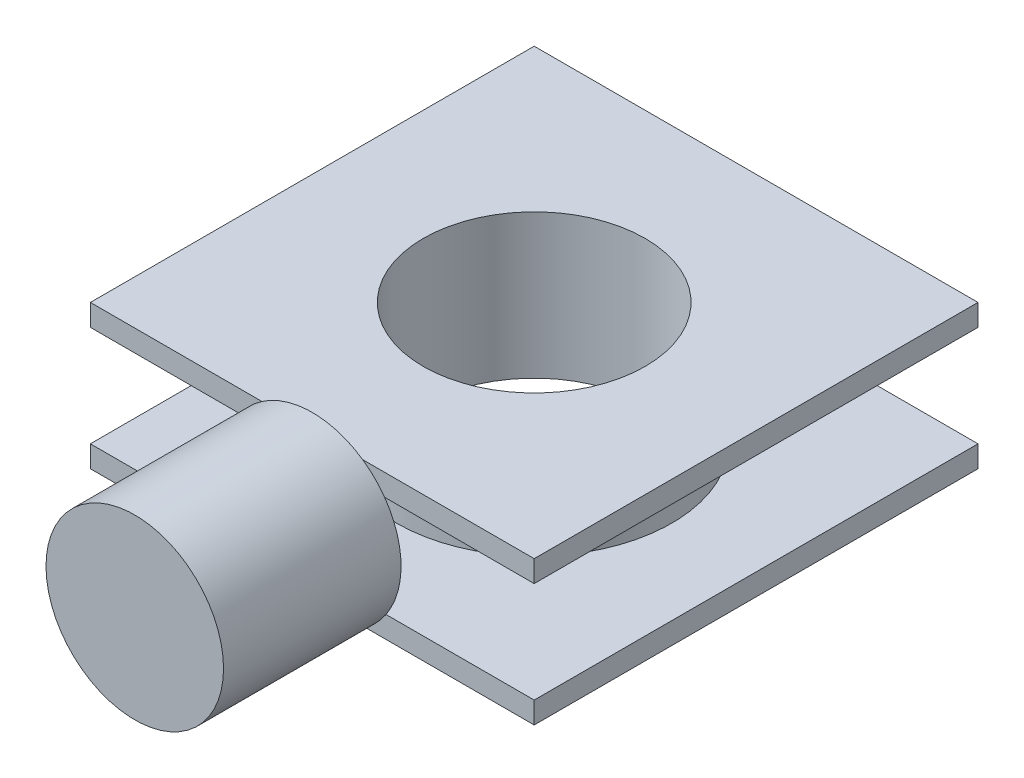
ISO-10303-21;
HEADER;
FILE_DESCRIPTION(('STEP AP214'),'2;1');
FILE_NAME('part.step','',(''),(''),'','','');
FILE_SCHEMA(('AUTOMOTIVE_DESIGN { 1 0 10303 214 1 1 1 1 }'));
ENDSEC;
DATA;
#1=APPLICATION_CONTEXT('core data for automotive mechanical design processes');
#2=APPLICATION_PROTOCOL_DEFINITION('international standard','automotive_design',2000,#1);
#3=PRODUCT_CONTEXT('',#1,'mechanical');
#4=PRODUCT('Part','Part','',(#3));
#5=PRODUCT_RELATED_PRODUCT_CATEGORY('part','',(#4));
#6=PRODUCT_DEFINITION_FORMATION('','',#4);
#7=PRODUCT_DEFINITION_CONTEXT('part definition',#1,'design');
#8=PRODUCT_DEFINITION('design','',#6,#7);
#9=PRODUCT_DEFINITION_SHAPE('','',#8);
#10=(LENGTH_UNIT() NAMED_UNIT(*) SI_UNIT(.MILLI.,.METRE.));
#11=(NAMED_UNIT(*) PLANE_ANGLE_UNIT() SI_UNIT($,.RADIAN.));
#12=(NAMED_UNIT(*) SI_UNIT($,.STERADIAN.) SOLID_ANGLE_UNIT());
#13=UNCERTAINTY_MEASURE_WITH_UNIT(LENGTH_MEASURE(1.E-05),#10,'distance_accuracy_value','');
#14=(GEOMETRIC_REPRESENTATION_CONTEXT(3) GLOBAL_UNCERTAINTY_ASSIGNED_CONTEXT((#13)) GLOBAL_UNIT_ASSIGNED_CONTEXT((#10,
#11,#12)) REPRESENTATION_CONTEXT('',''));
#15=CARTESIAN_POINT('',(0.,0.,0.));
#16=DIRECTION('',(0.,0.,1.));
#17=DIRECTION('',(1.,0.,0.));
#18=AXIS2_PLACEMENT_3D('',#15,#16,#17);
#19=CARTESIAN_POINT('',(0.,20.,25.));
#20=DIRECTION('',(0.,0.,1.));
#21=DIRECTION('',(1.,0.,0.));
#22=AXIS2_PLACEMENT_3D('',#19,#20,#21);
#23=PLANE('',#22);
#24=CARTESIAN_POINT('',(0.,8.,25.));
#25=DIRECTION('',(0.,0.,1.));
#26=DIRECTION('',(1.,0.,0.));
#27=AXIS2_PLACEMENT_3D('',#24,#25,#26);
#28=CIRCLE('',#27,10.);
#29=CARTESIAN_POINT('',(8.14972703725142,13.7949934614539,25.));
#30=VERTEX_POINT('',#29);
#31=CARTESIAN_POINT('',(5.67921824226726,16.2308249985466,25.));
#32=VERTEX_POINT('',#31);
#33=EDGE_CURVE('E53',#30,#32,#28,.T.);
#34=ORIENTED_EDGE('',*,*,#33,.F.);
#35=DIRECTION('',(-1.,0.,0.));
#36=VECTOR('',#35,1.);
#37=CARTESIAN_POINT('',(0.,13.7949934614539,25.));
#38=LINE('',#37,#36);
#39=CARTESIAN_POINT('',(25.,13.7949934614539,25.));
#40=VERTEX_POINT('',#39);
#41=EDGE_CURVE('E135',#40,#30,#38,.T.);
#42=ORIENTED_EDGE('',*,*,#41,.F.);
#43=DIRECTION('',(0.,-1.,0.));
#44=VECTOR('',#43,1.);
#45=CARTESIAN_POINT('',(25.,20.,25.));
#46=LINE('',#45,#44);
#47=CARTESIAN_POINT('',(25.,16.2308249985466,25.));
#48=VERTEX_POINT('',#47);
#49=EDGE_CURVE('E179',#48,#40,#46,.T.);
#50=ORIENTED_EDGE('',*,*,#49,.F.);
#51=DIRECTION('',(-1.,0.,0.));
#52=VECTOR('',#51,1.);
#53=CARTESIAN_POINT('',(0.,16.2308249985466,25.));
#54=LINE('',#53,#52);
#55=EDGE_CURVE('E39',#48,#32,#54,.T.);
#56=ORIENTED_EDGE('',*,*,#55,.T.);
#57=EDGE_LOOP('',(#34,#42,#50,#56));
#58=FACE_BOUND('',#57,.T.);
#59=ADVANCED_FACE('F35',(#58),#23,.T.);
#60=CARTESIAN_POINT('',(-8.30903299526411,2.43583153709268,25.));
#61=VERTEX_POINT('',#60);
#62=CARTESIAN_POINT('',(-6.00000000000001,0.,25.));
#63=VERTEX_POINT('',#62);
#64=EDGE_CURVE('E11',#61,#63,#28,.T.);
#65=ORIENTED_EDGE('',*,*,#64,.F.);
#66=DIRECTION('',(-1.,0.,0.));
#67=VECTOR('',#66,1.);
#68=CARTESIAN_POINT('',(0.,2.43583153709268,25.));
#69=LINE('',#68,#67);
#70=CARTESIAN_POINT('',(-25.,2.43583153709268,25.));
#71=VERTEX_POINT('',#70);
#72=EDGE_CURVE('E202',#61,#71,#69,.T.);
#73=ORIENTED_EDGE('',*,*,#72,.T.);
#74=DIRECTION('',(0.,-1.,0.));
#75=VECTOR('',#74,1.);
#76=CARTESIAN_POINT('',(-25.,20.,25.));
#77=LINE('',#76,#75);
#78=CARTESIAN_POINT('',(-25.,0.,25.));
#79=VERTEX_POINT('',#78);
#80=EDGE_CURVE('E186',#71,#79,#77,.T.);
#81=ORIENTED_EDGE('',*,*,#80,.T.);
#82=DIRECTION('',(-1.,0.,0.));
#83=VECTOR('',#82,1.);
#84=CARTESIAN_POINT('',(0.,0.,25.));
#85=LINE('',#84,#83);
#86=EDGE_CURVE('E167',#63,#79,#85,.T.);
#87=ORIENTED_EDGE('',*,*,#86,.F.);
#88=EDGE_LOOP('',(#65,#73,#81,#87));
#89=FACE_BOUND('',#88,.T.);
#90=ADVANCED_FACE('F242',(#89),#23,.T.);
#91=CARTESIAN_POINT('',(0.,0.,0.));
#92=DIRECTION('',(0.,1.,0.));
#93=DIRECTION('',(0.,0.,1.));
#94=AXIS2_PLACEMENT_3D('',#91,#92,#93);
#95=PLANE('',#94);
#96=CARTESIAN_POINT('',(0.,0.,0.));
#97=DIRECTION('',(0.,1.,0.));
#98=DIRECTION('',(0.,0.,1.));
#99=AXIS2_PLACEMENT_3D('',#96,#97,#98);
#100=CIRCLE('',#99,12.5);
#101=CARTESIAN_POINT('',(0.,0.,12.5));
#102=VERTEX_POINT('',#101);
#103=EDGE_CURVE('E205',#102,#102,#100,.T.);
#104=ORIENTED_EDGE('',*,*,#103,.T.);
#105=EDGE_LOOP('',(#104));
#106=FACE_BOUND('',#105,.T.);
#107=CARTESIAN_POINT('',(25.,0.,25.));
#108=VERTEX_POINT('',#107);
#109=CARTESIAN_POINT('',(6.00000000000002,0.,25.));
#110=VERTEX_POINT('',#109);
#111=EDGE_CURVE('E162',#108,#110,#85,.T.);
#112=ORIENTED_EDGE('',*,*,#111,.T.);
#113=EDGE_CURVE('E166',#110,#63,#85,.T.);
#114=ORIENTED_EDGE('',*,*,#113,.T.);
#115=ORIENTED_EDGE('',*,*,#86,.T.);
#116=DIRECTION('',(0.,0.,-1.));
#117=VECTOR('',#116,1.);
#118=CARTESIAN_POINT('',(-25.,0.,0.));
#119=LINE('',#118,#117);
#120=CARTESIAN_POINT('',(-25.,0.,-25.));
#121=VERTEX_POINT('',#120);
#122=EDGE_CURVE('E165',#79,#121,#119,.T.);
#123=ORIENTED_EDGE('',*,*,#122,.T.);
#124=DIRECTION('',(-1.,0.,0.));
#125=VECTOR('',#124,1.);
#126=CARTESIAN_POINT('',(0.,0.,-25.));
#127=LINE('',#126,#125);
#128=CARTESIAN_POINT('',(25.,0.,-25.));
#129=VERTEX_POINT('',#128);
#130=EDGE_CURVE('E170',#129,#121,#127,.T.);
#131=ORIENTED_EDGE('',*,*,#130,.F.);
#132=DIRECTION('',(0.,0.,-1.));
#133=VECTOR('',#132,1.);
#134=CARTESIAN_POINT('',(25.,0.,0.));
#135=LINE('',#134,#133);
#136=EDGE_CURVE('E173',#108,#129,#135,.T.);
#137=ORIENTED_EDGE('',*,*,#136,.F.);
#138=EDGE_LOOP('',(#112,#114,#115,#123,#131,#137));
#139=FACE_BOUND('',#138,.T.);
#140=ADVANCED_FACE('F234',(#106,#139),#95,.F.);
#141=CARTESIAN_POINT('',(0.,15.,0.));
#142=DIRECTION('',(0.,-1.,0.));
#143=DIRECTION('',(0.,0.,-1.));
#144=AXIS2_PLACEMENT_3D('',#141,#142,#143);
#145=CYLINDRICAL_SURFACE('',#144,12.5);
#146=ORIENTED_EDGE('',*,*,#103,.F.);
#147=EDGE_LOOP('',(#146));
#148=FACE_BOUND('',#147,.T.);
#149=CARTESIAN_POINT('',(0.,16.2308249985466,0.));
#150=DIRECTION('',(0.,-1.,0.));
#151=DIRECTION('',(0.,0.,-1.));
#152=AXIS2_PLACEMENT_3D('',#149,#150,#151);
#153=CIRCLE('',#152,12.5);
#154=CARTESIAN_POINT('',(0.,16.2308249985466,-12.5));
#155=VERTEX_POINT('',#154);
#156=EDGE_CURVE('E208',#155,#155,#153,.F.);
#157=ORIENTED_EDGE('',*,*,#156,.T.);
#158=EDGE_LOOP('',(#157));
#159=FACE_BOUND('',#158,.T.);
#160=ADVANCED_FACE('F37',(#148,#159),#145,.F.);
#161=CARTESIAN_POINT('',(0.,16.2308249985466,-50.));
#162=DIRECTION('',(0.,-1.,0.));
#163=DIRECTION('',(0.,0.,-1.));
#164=AXIS2_PLACEMENT_3D('',#161,#162,#163);
#165=PLANE('',#164);
#166=ORIENTED_EDGE('',*,*,#156,.F.);
#167=EDGE_LOOP('',(#166));
#168=FACE_BOUND('',#167,.T.);
#169=ORIENTED_EDGE('',*,*,#55,.F.);
#170=DIRECTION('',(0.,0.,-1.));
#171=VECTOR('',#170,1.);
#172=CARTESIAN_POINT('',(25.,16.2308249985466,-50.));
#173=LINE('',#172,#171);
#174=CARTESIAN_POINT('',(25.,16.2308249985466,-25.));
#175=VERTEX_POINT('',#174);
#176=EDGE_CURVE('E215',#48,#175,#173,.T.);
#177=ORIENTED_EDGE('',*,*,#176,.T.);
#178=DIRECTION('',(-1.,0.,0.));
#179=VECTOR('',#178,1.);
#180=CARTESIAN_POINT('',(0.,16.2308249985466,-25.));
#181=LINE('',#180,#179);
#182=CARTESIAN_POINT('',(-25.,16.2308249985466,-25.));
#183=VERTEX_POINT('',#182);
#184=EDGE_CURVE('E220',#175,#183,#181,.T.);
#185=ORIENTED_EDGE('',*,*,#184,.T.);
#186=DIRECTION('',(0.,0.,-1.));
#187=VECTOR('',#186,1.);
#188=CARTESIAN_POINT('',(-25.,16.2308249985466,-50.));
#189=LINE('',#188,#187);
#190=CARTESIAN_POINT('',(-25.,16.2308249985466,25.));
#191=VERTEX_POINT('',#190);
#192=EDGE_CURVE('E222',#191,#183,#189,.T.);
#193=ORIENTED_EDGE('',*,*,#192,.F.);
#194=CARTESIAN_POINT('',(-5.67921824226725,16.2308249985466,25.));
#195=VERTEX_POINT('',#194);
#196=EDGE_CURVE('E223',#195,#191,#54,.T.);
#197=ORIENTED_EDGE('',*,*,#196,.F.);
#198=EDGE_CURVE('E140',#32,#195,#54,.T.);
#199=ORIENTED_EDGE('',*,*,#198,.F.);
#200=EDGE_LOOP('',(#169,#177,#185,#193,#197,#199));
#201=FACE_BOUND('',#200,.T.);
#202=ADVANCED_FACE('F290',(#168,#201),#165,.F.);
#203=CARTESIAN_POINT('',(25.,20.,0.));
#204=DIRECTION('',(-1.,0.,0.));
#205=DIRECTION('',(0.,0.,1.));
#206=AXIS2_PLACEMENT_3D('',#203,#204,#205);
#207=PLANE('',#206);
#208=DIRECTION('',(0.,0.,-1.));
#209=VECTOR('',#208,1.);
#210=CARTESIAN_POINT('',(25.,13.7949934614539,-50.));
#211=LINE('',#210,#209);
#212=CARTESIAN_POINT('',(25.,13.7949934614539,-25.));
#213=VERTEX_POINT('',#212);
#214=EDGE_CURVE('E189',#40,#213,#211,.T.);
#215=ORIENTED_EDGE('',*,*,#214,.T.);
#216=DIRECTION('',(0.,-1.,0.));
#217=VECTOR('',#216,1.);
#218=CARTESIAN_POINT('',(25.,20.,-25.));
#219=LINE('',#218,#217);
#220=EDGE_CURVE('E182',#175,#213,#219,.T.);
#221=ORIENTED_EDGE('',*,*,#220,.F.);
#222=ORIENTED_EDGE('',*,*,#176,.F.);
#223=ORIENTED_EDGE('',*,*,#49,.T.);
#224=EDGE_LOOP('',(#215,#221,#222,#223));
#225=FACE_BOUND('',#224,.T.);
#226=ADVANCED_FACE('F294',(#225),#207,.F.);
#227=CARTESIAN_POINT('',(0.,20.,-25.));
#228=DIRECTION('',(0.,0.,1.));
#229=DIRECTION('',(1.,0.,0.));
#230=AXIS2_PLACEMENT_3D('',#227,#228,#229);
#231=PLANE('',#230);
#232=DIRECTION('',(-1.,0.,0.));
#233=VECTOR('',#232,1.);
#234=CARTESIAN_POINT('',(0.,13.7949934614539,-25.));
#235=LINE('',#234,#233);
#236=CARTESIAN_POINT('',(-25.,13.7949934614539,-25.));
#237=VERTEX_POINT('',#236);
#238=EDGE_CURVE('E194',#213,#237,#235,.T.);
#239=ORIENTED_EDGE('',*,*,#238,.T.);
#240=DIRECTION('',(0.,-1.,0.));
#241=VECTOR('',#240,1.);
#242=CARTESIAN_POINT('',(-25.,20.,-25.));
#243=LINE('',#242,#241);
#244=EDGE_CURVE('E185',#183,#237,#243,.T.);
#245=ORIENTED_EDGE('',*,*,#244,.F.);
#246=ORIENTED_EDGE('',*,*,#184,.F.);
#247=ORIENTED_EDGE('',*,*,#220,.T.);
#248=EDGE_LOOP('',(#239,#245,#246,#247));
#249=FACE_BOUND('',#248,.T.);
#250=ADVANCED_FACE('F280',(#249),#231,.F.);
#251=CARTESIAN_POINT('',(-25.,20.,0.));
#252=DIRECTION('',(-1.,0.,0.));
#253=DIRECTION('',(0.,0.,1.));
#254=AXIS2_PLACEMENT_3D('',#251,#252,#253);
#255=PLANE('',#254);
#256=CARTESIAN_POINT('',(-25.,13.7949934614539,25.));
#257=VERTEX_POINT('',#256);
#258=EDGE_CURVE('E146',#191,#257,#77,.T.);
#259=ORIENTED_EDGE('',*,*,#258,.F.);
#260=ORIENTED_EDGE('',*,*,#192,.T.);
#261=ORIENTED_EDGE('',*,*,#244,.T.);
#262=DIRECTION('',(0.,0.,-1.));
#263=VECTOR('',#262,1.);
#264=CARTESIAN_POINT('',(-25.,13.7949934614539,-50.));
#265=LINE('',#264,#263);
#266=EDGE_CURVE('E199',#257,#237,#265,.T.);
#267=ORIENTED_EDGE('',*,*,#266,.F.);
#268=EDGE_LOOP('',(#259,#260,#261,#267));
#269=FACE_BOUND('',#268,.T.);
#270=ADVANCED_FACE('F269',(#269),#255,.T.);
#271=CARTESIAN_POINT('',(-8.14972703725141,13.7949934614539,25.));
#272=VERTEX_POINT('',#271);
#273=EDGE_CURVE('E61',#195,#272,#28,.T.);
#274=ORIENTED_EDGE('',*,*,#273,.F.);
#275=ORIENTED_EDGE('',*,*,#196,.T.);
#276=ORIENTED_EDGE('',*,*,#258,.T.);
#277=EDGE_CURVE('E133',#272,#257,#38,.T.);
#278=ORIENTED_EDGE('',*,*,#277,.F.);
#279=EDGE_LOOP('',(#274,#275,#276,#278));
#280=FACE_BOUND('',#279,.T.);
#281=ADVANCED_FACE('F144',(#280),#23,.T.);
#282=CARTESIAN_POINT('',(0.,2.43583153709268,-50.));
#283=DIRECTION('',(0.,-1.,0.));
#284=DIRECTION('',(0.,0.,-1.));
#285=AXIS2_PLACEMENT_3D('',#282,#283,#284);
#286=PLANE('',#285);
#287=CARTESIAN_POINT('',(0.,2.43583153709268,0.));
#288=DIRECTION('',(0.,-1.,0.));
#289=DIRECTION('',(0.,0.,-1.));
#290=AXIS2_PLACEMENT_3D('',#287,#288,#289);
#291=CIRCLE('',#290,15.5);
#292=CARTESIAN_POINT('',(0.,2.43583153709268,-15.5));
#293=VERTEX_POINT('',#292);
#294=EDGE_CURVE('E212',#293,#293,#291,.T.);
#295=ORIENTED_EDGE('',*,*,#294,.T.);
#296=EDGE_LOOP('',(#295));
#297=FACE_BOUND('',#296,.T.);
#298=CARTESIAN_POINT('',(25.,2.43583153709268,25.));
#299=VERTEX_POINT('',#298);
#300=CARTESIAN_POINT('',(8.30903299526412,2.43583153709268,25.));
#301=VERTEX_POINT('',#300);
#302=EDGE_CURVE('E203',#299,#301,#69,.T.);
#303=ORIENTED_EDGE('',*,*,#302,.F.);
#304=DIRECTION('',(0.,0.,-1.));
#305=VECTOR('',#304,1.);
#306=CARTESIAN_POINT('',(25.,2.43583153709268,-50.));
#307=LINE('',#306,#305);
#308=CARTESIAN_POINT('',(25.,2.43583153709268,-25.));
#309=VERTEX_POINT('',#308);
#310=EDGE_CURVE('E191',#299,#309,#307,.T.);
#311=ORIENTED_EDGE('',*,*,#310,.T.);
#312=DIRECTION('',(-1.,0.,0.));
#313=VECTOR('',#312,1.);
#314=CARTESIAN_POINT('',(0.,2.43583153709268,-25.));
#315=LINE('',#314,#313);
#316=CARTESIAN_POINT('',(-25.,2.43583153709268,-25.));
#317=VERTEX_POINT('',#316);
#318=EDGE_CURVE('E196',#309,#317,#315,.T.);
#319=ORIENTED_EDGE('',*,*,#318,.T.);
#320=DIRECTION('',(0.,0.,-1.));
#321=VECTOR('',#320,1.);
#322=CARTESIAN_POINT('',(-25.,2.43583153709268,-50.));
#323=LINE('',#322,#321);
#324=EDGE_CURVE('E147',#71,#317,#323,.T.);
#325=ORIENTED_EDGE('',*,*,#324,.F.);
#326=ORIENTED_EDGE('',*,*,#72,.F.);
#327=EDGE_CURVE('E153',#301,#61,#69,.T.);
#328=ORIENTED_EDGE('',*,*,#327,.F.);
#329=EDGE_LOOP('',(#303,#311,#319,#325,#326,#328));
#330=FACE_BOUND('',#329,.T.);
#331=ADVANCED_FACE('F247',(#297,#330),#286,.F.);
#332=CARTESIAN_POINT('',(0.,13.7949934614539,-50.));
#333=DIRECTION('',(0.,-1.,0.));
#334=DIRECTION('',(0.,0.,-1.));
#335=AXIS2_PLACEMENT_3D('',#332,#333,#334);
#336=PLANE('',#335);
#337=CARTESIAN_POINT('',(0.,13.7949934614539,0.));
#338=DIRECTION('',(0.,-1.,0.));
#339=DIRECTION('',(0.,0.,-1.));
#340=AXIS2_PLACEMENT_3D('',#337,#338,#339);
#341=CIRCLE('',#340,15.5);
#342=CARTESIAN_POINT('',(0.,13.7949934614539,-15.5));
#343=VERTEX_POINT('',#342);
#344=EDGE_CURVE('E211',#343,#343,#341,.T.);
#345=ORIENTED_EDGE('',*,*,#344,.F.);
#346=EDGE_LOOP('',(#345));
#347=FACE_BOUND('',#346,.T.);
#348=ORIENTED_EDGE('',*,*,#214,.F.);
#349=ORIENTED_EDGE('',*,*,#41,.T.);
#350=EDGE_CURVE('E129',#30,#272,#38,.T.);
#351=ORIENTED_EDGE('',*,*,#350,.T.);
#352=ORIENTED_EDGE('',*,*,#277,.T.);
#353=ORIENTED_EDGE('',*,*,#266,.T.);
#354=ORIENTED_EDGE('',*,*,#238,.F.);
#355=EDGE_LOOP('',(#348,#349,#351,#352,#353,#354));
#356=FACE_BOUND('',#355,.T.);
#357=ADVANCED_FACE('F131',(#347,#356),#336,.T.);
#358=CARTESIAN_POINT('',(0.,15.,0.));
#359=DIRECTION('',(0.,-1.,0.));
#360=DIRECTION('',(0.,0.,-1.));
#361=AXIS2_PLACEMENT_3D('',#358,#359,#360);
#362=CYLINDRICAL_SURFACE('',#361,15.5);
#363=ORIENTED_EDGE('',*,*,#344,.T.);
#364=EDGE_LOOP('',(#363));
#365=FACE_BOUND('',#364,.T.);
#366=ORIENTED_EDGE('',*,*,#294,.F.);
#367=EDGE_LOOP('',(#366));
#368=FACE_BOUND('',#367,.T.);
#369=ADVANCED_FACE('F262',(#365,#368),#362,.T.);
#370=EDGE_CURVE('E44',#110,#301,#28,.T.);
#371=ORIENTED_EDGE('',*,*,#370,.F.);
#372=ORIENTED_EDGE('',*,*,#111,.F.);
#373=EDGE_CURVE('E176',#299,#108,#46,.T.);
#374=ORIENTED_EDGE('',*,*,#373,.F.);
#375=ORIENTED_EDGE('',*,*,#302,.T.);
#376=EDGE_LOOP('',(#371,#372,#374,#375));
#377=FACE_BOUND('',#376,.T.);
#378=ADVANCED_FACE('F260',(#377),#23,.T.);
#379=ORIENTED_EDGE('',*,*,#324,.T.);
#380=EDGE_CURVE('E183',#317,#121,#243,.T.);
#381=ORIENTED_EDGE('',*,*,#380,.T.);
#382=ORIENTED_EDGE('',*,*,#122,.F.);
#383=ORIENTED_EDGE('',*,*,#80,.F.);
#384=EDGE_LOOP('',(#379,#381,#382,#383));
#385=FACE_BOUND('',#384,.T.);
#386=ADVANCED_FACE('F251',(#385),#255,.T.);
#387=EDGE_CURVE('E180',#309,#129,#219,.T.);
#388=ORIENTED_EDGE('',*,*,#387,.T.);
#389=ORIENTED_EDGE('',*,*,#130,.T.);
#390=ORIENTED_EDGE('',*,*,#380,.F.);
#391=ORIENTED_EDGE('',*,*,#318,.F.);
#392=EDGE_LOOP('',(#388,#389,#390,#391));
#393=FACE_BOUND('',#392,.T.);
#394=ADVANCED_FACE('F254',(#393),#231,.F.);
#395=ORIENTED_EDGE('',*,*,#373,.T.);
#396=ORIENTED_EDGE('',*,*,#136,.T.);
#397=ORIENTED_EDGE('',*,*,#387,.F.);
#398=ORIENTED_EDGE('',*,*,#310,.F.);
#399=EDGE_LOOP('',(#395,#396,#397,#398));
#400=FACE_BOUND('',#399,.T.);
#401=ADVANCED_FACE('F257',(#400),#207,.F.);
#402=CARTESIAN_POINT('',(0.,8.,25.));
#403=DIRECTION('',(0.,0.,1.));
#404=DIRECTION('',(1.,0.,0.));
#405=AXIS2_PLACEMENT_3D('',#402,#403,#404);
#406=PLANE('',#405);
#407=EDGE_CURVE('E46',#32,#195,#28,.T.);
#408=ORIENTED_EDGE('',*,*,#407,.F.);
#409=ORIENTED_EDGE('',*,*,#198,.T.);
#410=EDGE_LOOP('',(#408,#409));
#411=FACE_BOUND('',#410,.T.);
#412=ADVANCED_FACE('F366',(#411),#406,.F.);
#413=ORIENTED_EDGE('',*,*,#350,.F.);
#414=EDGE_CURVE('E161',#301,#30,#28,.T.);
#415=ORIENTED_EDGE('',*,*,#414,.F.);
#416=ORIENTED_EDGE('',*,*,#327,.T.);
#417=EDGE_CURVE('E150',#272,#61,#28,.T.);
#418=ORIENTED_EDGE('',*,*,#417,.F.);
#419=EDGE_LOOP('',(#413,#415,#416,#418));
#420=FACE_BOUND('',#419,.T.);
#421=ADVANCED_FACE('F151',(#420),#406,.F.);
#422=CARTESIAN_POINT('',(0.,8.,45.));
#423=DIRECTION('',(0.,0.,-1.));
#424=DIRECTION('',(-1.,0.,0.));
#425=AXIS2_PLACEMENT_3D('',#422,#423,#424);
#426=CYLINDRICAL_SURFACE('',#425,10.);
#427=CARTESIAN_POINT('',(0.,8.,45.));
#428=DIRECTION('',(0.,0.,1.));
#429=DIRECTION('',(1.,0.,0.));
#430=AXIS2_PLACEMENT_3D('',#427,#428,#429);
#431=CIRCLE('',#430,10.);
#432=CARTESIAN_POINT('',(10.,8.,45.));
#433=VERTEX_POINT('',#432);
#434=EDGE_CURVE('E141',#433,#433,#431,.T.);
#435=ORIENTED_EDGE('',*,*,#434,.F.);
#436=EDGE_LOOP('',(#435));
#437=FACE_BOUND('',#436,.T.);
#438=ORIENTED_EDGE('',*,*,#33,.T.);
#439=ORIENTED_EDGE('',*,*,#407,.T.);
#440=ORIENTED_EDGE('',*,*,#273,.T.);
#441=ORIENTED_EDGE('',*,*,#417,.T.);
#442=ORIENTED_EDGE('',*,*,#64,.T.);
#443=EDGE_CURVE('E155',#63,#110,#28,.T.);
#444=ORIENTED_EDGE('',*,*,#443,.T.);
#445=ORIENTED_EDGE('',*,*,#370,.T.);
#446=ORIENTED_EDGE('',*,*,#414,.T.);
#447=EDGE_LOOP('',(#438,#439,#440,#441,#442,#444,#445,#446));
#448=FACE_BOUND('',#447,.T.);
#449=ADVANCED_FACE('F157',(#437,#448),#426,.T.);
#450=CARTESIAN_POINT('',(0.,8.,45.));
#451=DIRECTION('',(0.,0.,1.));
#452=DIRECTION('',(1.,0.,0.));
#453=AXIS2_PLACEMENT_3D('',#450,#451,#452);
#454=PLANE('',#453);
#455=ORIENTED_EDGE('',*,*,#434,.T.);
#456=EDGE_LOOP('',(#455));
#457=FACE_BOUND('',#456,.T.);
#458=ADVANCED_FACE('F418',(#457),#454,.T.);
#459=ORIENTED_EDGE('',*,*,#113,.F.);
#460=ORIENTED_EDGE('',*,*,#443,.F.);
#461=EDGE_LOOP('',(#459,#460));
#462=FACE_BOUND('',#461,.T.);
#463=ADVANCED_FACE('F238',(#462),#406,.F.);
#464=CLOSED_SHELL('',(#59,#90,#140,#160,#202,#226,#250,#270,#281,#331,#357,#369,#378,#386,#394,
#401,#412,#421,#449,#458,#463));
#465=MANIFOLD_SOLID_BREP('B2',#464);
#466=ADVANCED_BREP_SHAPE_REPRESENTATION('',(#18,#465),#14);
#467=SHAPE_DEFINITION_REPRESENTATION(#9,#466);
ENDSEC;
END-ISO-10303-21;
